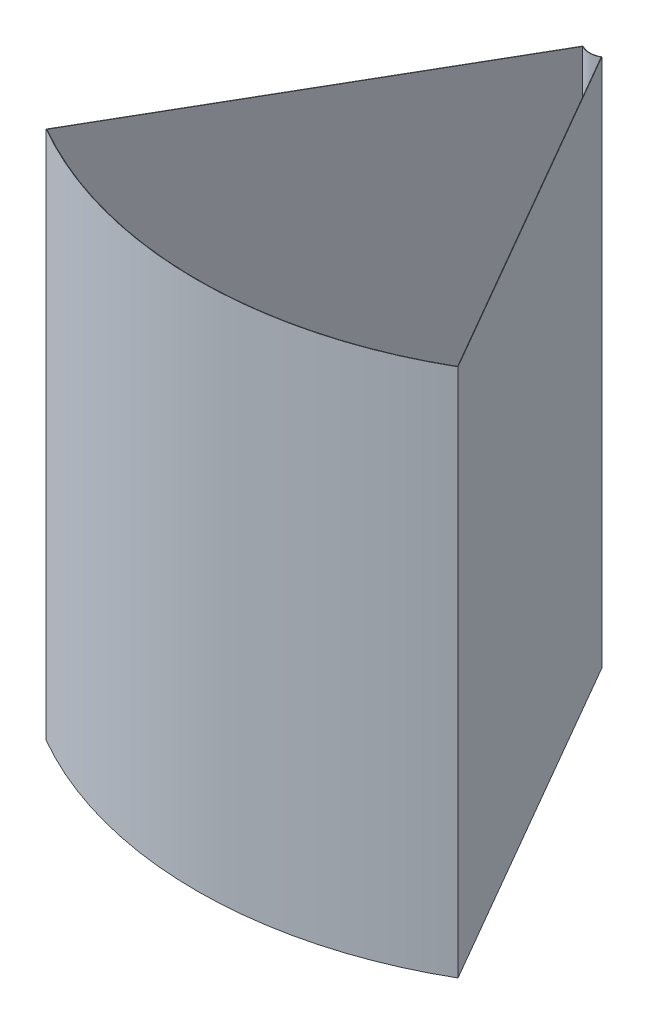
ISO-10303-21;
HEADER;
FILE_DESCRIPTION(('STEP AP214'),'2;1');
FILE_NAME('part.step','',(''),(''),'','','');
FILE_SCHEMA(('AUTOMOTIVE_DESIGN { 1 0 10303 214 1 1 1 1 }'));
ENDSEC;
DATA;
#1=APPLICATION_CONTEXT('core data for automotive mechanical design processes');
#2=APPLICATION_PROTOCOL_DEFINITION('international standard','automotive_design',2000,#1);
#3=PRODUCT_CONTEXT('',#1,'mechanical');
#4=PRODUCT('Part','Part','',(#3));
#5=PRODUCT_RELATED_PRODUCT_CATEGORY('part','',(#4));
#6=PRODUCT_DEFINITION_FORMATION('','',#4);
#7=PRODUCT_DEFINITION_CONTEXT('part definition',#1,'design');
#8=PRODUCT_DEFINITION('design','',#6,#7);
#9=PRODUCT_DEFINITION_SHAPE('','',#8);
#10=(LENGTH_UNIT() NAMED_UNIT(*) SI_UNIT(.MILLI.,.METRE.));
#11=(NAMED_UNIT(*) PLANE_ANGLE_UNIT() SI_UNIT($,.RADIAN.));
#12=(NAMED_UNIT(*) SI_UNIT($,.STERADIAN.) SOLID_ANGLE_UNIT());
#13=UNCERTAINTY_MEASURE_WITH_UNIT(LENGTH_MEASURE(1.E-05),#10,'distance_accuracy_value','');
#14=(GEOMETRIC_REPRESENTATION_CONTEXT(3) GLOBAL_UNCERTAINTY_ASSIGNED_CONTEXT((#13)) GLOBAL_UNIT_ASSIGNED_CONTEXT((#10,
#11,#12)) REPRESENTATION_CONTEXT('',''));
#15=CARTESIAN_POINT('',(0.,0.,0.));
#16=DIRECTION('',(0.,0.,1.));
#17=DIRECTION('',(1.,0.,0.));
#18=AXIS2_PLACEMENT_3D('',#15,#16,#17);
#19=CARTESIAN_POINT('',(0.,450.,0.));
#20=DIRECTION('',(0.,-1.,0.));
#21=DIRECTION('',(0.,0.,-1.));
#22=AXIS2_PLACEMENT_3D('',#19,#20,#21);
#23=CYLINDRICAL_SURFACE('',#22,16.);
#24=CARTESIAN_POINT('',(0.,0.,0.));
#25=DIRECTION('',(0.,-1.,0.));
#26=DIRECTION('',(0.,0.,1.));
#27=AXIS2_PLACEMENT_3D('',#24,#25,#26);
#28=CIRCLE('',#27,16.);
#29=CARTESIAN_POINT('',(7.99999999999992,0.,13.8564064605511));
#30=VERTEX_POINT('',#29);
#31=CARTESIAN_POINT('',(-7.99999999999997,0.,13.856406460551));
#32=VERTEX_POINT('',#31);
#33=EDGE_CURVE('E167',#30,#32,#28,.T.);
#34=ORIENTED_EDGE('',*,*,#33,.T.);
#35=DIRECTION('',(0.,-1.,0.));
#36=VECTOR('',#35,1.);
#37=CARTESIAN_POINT('',(-7.99999999999997,450.,13.856406460551));
#38=LINE('',#37,#36);
#39=CARTESIAN_POINT('',(-7.99999999999997,450.,13.856406460551));
#40=VERTEX_POINT('',#39);
#41=EDGE_CURVE('E11',#40,#32,#38,.T.);
#42=ORIENTED_EDGE('',*,*,#41,.F.);
#43=CARTESIAN_POINT('',(0.,450.,0.));
#44=DIRECTION('',(0.,-1.,0.));
#45=DIRECTION('',(0.,0.,1.));
#46=AXIS2_PLACEMENT_3D('',#43,#44,#45);
#47=CIRCLE('',#46,16.);
#48=CARTESIAN_POINT('',(7.99999999999992,450.,13.8564064605511));
#49=VERTEX_POINT('',#48);
#50=EDGE_CURVE('E156',#49,#40,#47,.T.);
#51=ORIENTED_EDGE('',*,*,#50,.F.);
#52=DIRECTION('',(0.,-1.,0.));
#53=VECTOR('',#52,1.);
#54=CARTESIAN_POINT('',(7.99999999999992,450.,13.8564064605511));
#55=LINE('',#54,#53);
#56=EDGE_CURVE('E166',#49,#30,#55,.T.);
#57=ORIENTED_EDGE('',*,*,#56,.T.);
#58=EDGE_LOOP('',(#34,#42,#51,#57));
#59=FACE_BOUND('',#58,.T.);
#60=ADVANCED_FACE('F39',(#59),#23,.F.);
#61=CARTESIAN_POINT('',(-7.99999999999997,450.,13.856406460551));
#62=DIRECTION('',(0.86602540378444,0.,0.499999999999998));
#63=DIRECTION('',(0.499999999999998,0.,-0.86602540378444));
#64=AXIS2_PLACEMENT_3D('',#61,#62,#63);
#65=PLANE('',#64);
#66=DIRECTION('',(-0.499999999999998,0.,0.86602540378444));
#67=VECTOR('',#66,1.);
#68=CARTESIAN_POINT('',(-7.99999999999997,0.,13.856406460551));
#69=LINE('',#68,#67);
#70=CARTESIAN_POINT('',(-175.087499999999,0.,303.260445770216));
#71=VERTEX_POINT('',#70);
#72=EDGE_CURVE('E171',#32,#71,#69,.T.);
#73=ORIENTED_EDGE('',*,*,#72,.T.);
#74=DIRECTION('',(0.,-1.,0.));
#75=VECTOR('',#74,1.);
#76=CARTESIAN_POINT('',(-175.087499999999,450.,303.260445770216));
#77=LINE('',#76,#75);
#78=CARTESIAN_POINT('',(-175.087499999999,450.,303.260445770216));
#79=VERTEX_POINT('',#78);
#80=EDGE_CURVE('E47',#79,#71,#77,.T.);
#81=ORIENTED_EDGE('',*,*,#80,.F.);
#82=DIRECTION('',(-0.499999999999998,0.,0.86602540378444));
#83=VECTOR('',#82,1.);
#84=CARTESIAN_POINT('',(-7.99999999999997,450.,13.856406460551));
#85=LINE('',#84,#83);
#86=EDGE_CURVE('E91',#40,#79,#85,.T.);
#87=ORIENTED_EDGE('',*,*,#86,.F.);
#88=ORIENTED_EDGE('',*,*,#41,.T.);
#89=EDGE_LOOP('',(#73,#81,#87,#88));
#90=FACE_BOUND('',#89,.T.);
#91=ADVANCED_FACE('F206',(#90),#65,.F.);
#92=CARTESIAN_POINT('',(0.,450.,0.));
#93=DIRECTION('',(0.,-1.,0.));
#94=DIRECTION('',(0.,0.,-1.));
#95=AXIS2_PLACEMENT_3D('',#92,#93,#94);
#96=CYLINDRICAL_SURFACE('',#95,350.175);
#97=CARTESIAN_POINT('',(0.,0.,0.));
#98=DIRECTION('',(0.,1.,0.));
#99=DIRECTION('',(0.,0.,1.));
#100=AXIS2_PLACEMENT_3D('',#97,#98,#99);
#101=CIRCLE('',#100,350.175);
#102=CARTESIAN_POINT('',(175.087499999999,0.,303.260445770217));
#103=VERTEX_POINT('',#102);
#104=EDGE_CURVE('E174',#71,#103,#101,.T.);
#105=ORIENTED_EDGE('',*,*,#104,.T.);
#106=DIRECTION('',(0.,-1.,0.));
#107=VECTOR('',#106,1.);
#108=CARTESIAN_POINT('',(175.087499999999,450.,303.260445770217));
#109=LINE('',#108,#107);
#110=CARTESIAN_POINT('',(175.087499999999,450.,303.260445770217));
#111=VERTEX_POINT('',#110);
#112=EDGE_CURVE('E181',#111,#103,#109,.T.);
#113=ORIENTED_EDGE('',*,*,#112,.F.);
#114=CARTESIAN_POINT('',(0.,450.,0.));
#115=DIRECTION('',(0.,1.,0.));
#116=DIRECTION('',(0.,0.,1.));
#117=AXIS2_PLACEMENT_3D('',#114,#115,#116);
#118=CIRCLE('',#117,350.175);
#119=EDGE_CURVE('E161',#79,#111,#118,.T.);
#120=ORIENTED_EDGE('',*,*,#119,.F.);
#121=ORIENTED_EDGE('',*,*,#80,.T.);
#122=EDGE_LOOP('',(#105,#113,#120,#121));
#123=FACE_BOUND('',#122,.T.);
#124=ADVANCED_FACE('F188',(#123),#96,.T.);
#125=CARTESIAN_POINT('',(175.087499999999,450.,303.260445770217));
#126=DIRECTION('',(-0.866025403784441,0.,0.499999999999996));
#127=DIRECTION('',(0.499999999999996,0.,0.866025403784441));
#128=AXIS2_PLACEMENT_3D('',#125,#126,#127);
#129=PLANE('',#128);
#130=DIRECTION('',(-0.499999999999996,0.,-0.866025403784441));
#131=VECTOR('',#130,1.);
#132=CARTESIAN_POINT('',(175.087499999999,0.,303.260445770217));
#133=LINE('',#132,#131);
#134=EDGE_CURVE('E84',#103,#30,#133,.T.);
#135=ORIENTED_EDGE('',*,*,#134,.T.);
#136=ORIENTED_EDGE('',*,*,#56,.F.);
#137=DIRECTION('',(-0.499999999999996,0.,-0.866025403784441));
#138=VECTOR('',#137,1.);
#139=CARTESIAN_POINT('',(175.087499999999,450.,303.260445770217));
#140=LINE('',#139,#138);
#141=EDGE_CURVE('E63',#111,#49,#140,.T.);
#142=ORIENTED_EDGE('',*,*,#141,.F.);
#143=ORIENTED_EDGE('',*,*,#112,.T.);
#144=EDGE_LOOP('',(#135,#136,#142,#143));
#145=FACE_BOUND('',#144,.T.);
#146=ADVANCED_FACE('F196',(#145),#129,.F.);
#147=CARTESIAN_POINT('',(0.,450.,0.));
#148=DIRECTION('',(0.,1.,0.));
#149=DIRECTION('',(0.,0.,1.));
#150=AXIS2_PLACEMENT_3D('',#147,#148,#149);
#151=PLANE('',#150);
#152=CARTESIAN_POINT('',(0.,450.,0.));
#153=DIRECTION('',(0.,1.,0.));
#154=DIRECTION('',(0.,0.,1.));
#155=AXIS2_PLACEMENT_3D('',#152,#153,#154);
#156=CIRCLE('',#155,16.35);
#157=CARTESIAN_POINT('',(7.87001780535637,450.,14.3312706953492));
#158=VERTEX_POINT('',#157);
#159=CARTESIAN_POINT('',(-7.87001780535643,450.,14.3312706953491));
#160=VERTEX_POINT('',#159);
#161=EDGE_CURVE('E140',#158,#160,#156,.F.);
#162=ORIENTED_EDGE('',*,*,#161,.F.);
#163=DIRECTION('',(-0.499999999999996,0.,-0.866025403784441));
#164=VECTOR('',#163,1.);
#165=CARTESIAN_POINT('',(174.784391108674,450.,303.435445770217));
#166=LINE('',#165,#164);
#167=CARTESIAN_POINT('',(174.60930356488,450.,303.132185248593));
#168=VERTEX_POINT('',#167);
#169=EDGE_CURVE('E153',#168,#158,#166,.T.);
#170=ORIENTED_EDGE('',*,*,#169,.F.);
#171=CARTESIAN_POINT('',(0.,450.,0.));
#172=DIRECTION('',(0.,1.,0.));
#173=DIRECTION('',(0.,0.,1.));
#174=AXIS2_PLACEMENT_3D('',#171,#172,#173);
#175=CIRCLE('',#174,349.825);
#176=CARTESIAN_POINT('',(-174.609303564881,450.,303.132185248593));
#177=VERTEX_POINT('',#176);
#178=EDGE_CURVE('E150',#177,#168,#175,.T.);
#179=ORIENTED_EDGE('',*,*,#178,.F.);
#180=DIRECTION('',(-0.499999999999998,0.,0.86602540378444));
#181=VECTOR('',#180,1.);
#182=CARTESIAN_POINT('',(-7.69689110867541,450.,14.031406460551));
#183=LINE('',#182,#181);
#184=EDGE_CURVE('E129',#160,#177,#183,.T.);
#185=ORIENTED_EDGE('',*,*,#184,.F.);
#186=EDGE_LOOP('',(#162,#170,#179,#185));
#187=FACE_BOUND('',#186,.T.);
#188=ORIENTED_EDGE('',*,*,#50,.T.);
#189=ORIENTED_EDGE('',*,*,#86,.T.);
#190=ORIENTED_EDGE('',*,*,#119,.T.);
#191=ORIENTED_EDGE('',*,*,#141,.T.);
#192=EDGE_LOOP('',(#188,#189,#190,#191));
#193=FACE_BOUND('',#192,.T.);
#194=ADVANCED_FACE('F198',(#187,#193),#151,.T.);
#195=CARTESIAN_POINT('',(0.,0.,0.));
#196=DIRECTION('',(0.,1.,0.));
#197=DIRECTION('',(0.,0.,1.));
#198=AXIS2_PLACEMENT_3D('',#195,#196,#197);
#199=PLANE('',#198);
#200=ORIENTED_EDGE('',*,*,#33,.F.);
#201=ORIENTED_EDGE('',*,*,#134,.F.);
#202=ORIENTED_EDGE('',*,*,#104,.F.);
#203=ORIENTED_EDGE('',*,*,#72,.F.);
#204=EDGE_LOOP('',(#200,#201,#202,#203));
#205=FACE_BOUND('',#204,.T.);
#206=ADVANCED_FACE('F192',(#205),#199,.F.);
#207=CARTESIAN_POINT('',(0.,450.,0.));
#208=DIRECTION('',(0.,-1.,0.));
#209=DIRECTION('',(0.,0.,-1.));
#210=AXIS2_PLACEMENT_3D('',#207,#208,#209);
#211=CYLINDRICAL_SURFACE('',#210,16.35);
#212=CARTESIAN_POINT('',(0.,0.350000000000017,0.));
#213=DIRECTION('',(0.,1.,0.));
#214=DIRECTION('',(0.,0.,1.));
#215=AXIS2_PLACEMENT_3D('',#212,#213,#214);
#216=CIRCLE('',#215,16.35);
#217=CARTESIAN_POINT('',(7.87001780535637,0.35,14.3312706953492));
#218=VERTEX_POINT('',#217);
#219=CARTESIAN_POINT('',(-7.87001780535643,0.35,14.3312706953491));
#220=VERTEX_POINT('',#219);
#221=EDGE_CURVE('E119',#218,#220,#216,.F.);
#222=ORIENTED_EDGE('',*,*,#221,.F.);
#223=DIRECTION('',(0.,-1.,0.));
#224=VECTOR('',#223,1.);
#225=CARTESIAN_POINT('',(7.87001780535637,450.,14.3312706953492));
#226=LINE('',#225,#224);
#227=EDGE_CURVE('E144',#158,#218,#226,.T.);
#228=ORIENTED_EDGE('',*,*,#227,.F.);
#229=ORIENTED_EDGE('',*,*,#161,.T.);
#230=DIRECTION('',(0.,-1.,0.));
#231=VECTOR('',#230,1.);
#232=CARTESIAN_POINT('',(-7.87001780535643,450.,14.3312706953491));
#233=LINE('',#232,#231);
#234=EDGE_CURVE('E133',#160,#220,#233,.T.);
#235=ORIENTED_EDGE('',*,*,#234,.T.);
#236=EDGE_LOOP('',(#222,#228,#229,#235));
#237=FACE_BOUND('',#236,.T.);
#238=ADVANCED_FACE('F233',(#237),#211,.T.);
#239=CARTESIAN_POINT('',(-7.69689110867541,450.,14.031406460551));
#240=DIRECTION('',(0.86602540378444,0.,0.499999999999998));
#241=DIRECTION('',(0.499999999999998,0.,-0.86602540378444));
#242=AXIS2_PLACEMENT_3D('',#239,#240,#241);
#243=PLANE('',#242);
#244=DIRECTION('',(-0.499999999999998,0.,0.86602540378444));
#245=VECTOR('',#244,1.);
#246=CARTESIAN_POINT('',(-7.69689110867541,0.350000000000017,14.031406460551));
#247=LINE('',#246,#245);
#248=CARTESIAN_POINT('',(-174.609303564881,0.35,303.132185248593));
#249=VERTEX_POINT('',#248);
#250=EDGE_CURVE('E113',#220,#249,#247,.T.);
#251=ORIENTED_EDGE('',*,*,#250,.F.);
#252=ORIENTED_EDGE('',*,*,#234,.F.);
#253=ORIENTED_EDGE('',*,*,#184,.T.);
#254=DIRECTION('',(0.,-1.,0.));
#255=VECTOR('',#254,1.);
#256=CARTESIAN_POINT('',(-174.609303564881,450.,303.132185248593));
#257=LINE('',#256,#255);
#258=EDGE_CURVE('E126',#177,#249,#257,.T.);
#259=ORIENTED_EDGE('',*,*,#258,.T.);
#260=EDGE_LOOP('',(#251,#252,#253,#259));
#261=FACE_BOUND('',#260,.T.);
#262=ADVANCED_FACE('F127',(#261),#243,.T.);
#263=CARTESIAN_POINT('',(0.,450.,0.));
#264=DIRECTION('',(0.,-1.,0.));
#265=DIRECTION('',(0.,0.,-1.));
#266=AXIS2_PLACEMENT_3D('',#263,#264,#265);
#267=CYLINDRICAL_SURFACE('',#266,349.825);
#268=CARTESIAN_POINT('',(0.,0.350000000000017,0.));
#269=DIRECTION('',(0.,1.,0.));
#270=DIRECTION('',(0.,0.,1.));
#271=AXIS2_PLACEMENT_3D('',#268,#269,#270);
#272=CIRCLE('',#271,349.825);
#273=CARTESIAN_POINT('',(174.60930356488,0.35,303.132185248593));
#274=VERTEX_POINT('',#273);
#275=EDGE_CURVE('E117',#249,#274,#272,.T.);
#276=ORIENTED_EDGE('',*,*,#275,.F.);
#277=ORIENTED_EDGE('',*,*,#258,.F.);
#278=ORIENTED_EDGE('',*,*,#178,.T.);
#279=DIRECTION('',(0.,-1.,0.));
#280=VECTOR('',#279,1.);
#281=CARTESIAN_POINT('',(174.60930356488,450.,303.132185248593));
#282=LINE('',#281,#280);
#283=EDGE_CURVE('E54',#168,#274,#282,.T.);
#284=ORIENTED_EDGE('',*,*,#283,.T.);
#285=EDGE_LOOP('',(#276,#277,#278,#284));
#286=FACE_BOUND('',#285,.T.);
#287=ADVANCED_FACE('F135',(#286),#267,.F.);
#288=CARTESIAN_POINT('',(174.784391108674,450.,303.435445770217));
#289=DIRECTION('',(-0.866025403784441,0.,0.499999999999996));
#290=DIRECTION('',(0.499999999999996,0.,0.866025403784441));
#291=AXIS2_PLACEMENT_3D('',#288,#289,#290);
#292=PLANE('',#291);
#293=DIRECTION('',(-0.499999999999996,0.,-0.866025403784441));
#294=VECTOR('',#293,1.);
#295=CARTESIAN_POINT('',(174.784391108674,0.350000000000017,303.435445770217));
#296=LINE('',#295,#294);
#297=EDGE_CURVE('E137',#274,#218,#296,.T.);
#298=ORIENTED_EDGE('',*,*,#297,.F.);
#299=ORIENTED_EDGE('',*,*,#283,.F.);
#300=ORIENTED_EDGE('',*,*,#169,.T.);
#301=ORIENTED_EDGE('',*,*,#227,.T.);
#302=EDGE_LOOP('',(#298,#299,#300,#301));
#303=FACE_BOUND('',#302,.T.);
#304=ADVANCED_FACE('F263',(#303),#292,.T.);
#305=CARTESIAN_POINT('',(0.,0.35,0.));
#306=DIRECTION('',(0.,1.,0.));
#307=DIRECTION('',(0.,0.,1.));
#308=AXIS2_PLACEMENT_3D('',#305,#306,#307);
#309=PLANE('',#308);
#310=ORIENTED_EDGE('',*,*,#221,.T.);
#311=ORIENTED_EDGE('',*,*,#250,.T.);
#312=ORIENTED_EDGE('',*,*,#275,.T.);
#313=ORIENTED_EDGE('',*,*,#297,.T.);
#314=EDGE_LOOP('',(#310,#311,#312,#313));
#315=FACE_BOUND('',#314,.T.);
#316=ADVANCED_FACE('F115',(#315),#309,.T.);
#317=CLOSED_SHELL('',(#60,#91,#124,#146,#194,#206,#238,#262,#287,#304,#316));
#318=MANIFOLD_SOLID_BREP('B2',#317);
#319=ADVANCED_BREP_SHAPE_REPRESENTATION('',(#18,#318),#14);
#320=SHAPE_DEFINITION_REPRESENTATION(#9,#319);
ENDSEC;
END-ISO-10303-21;
